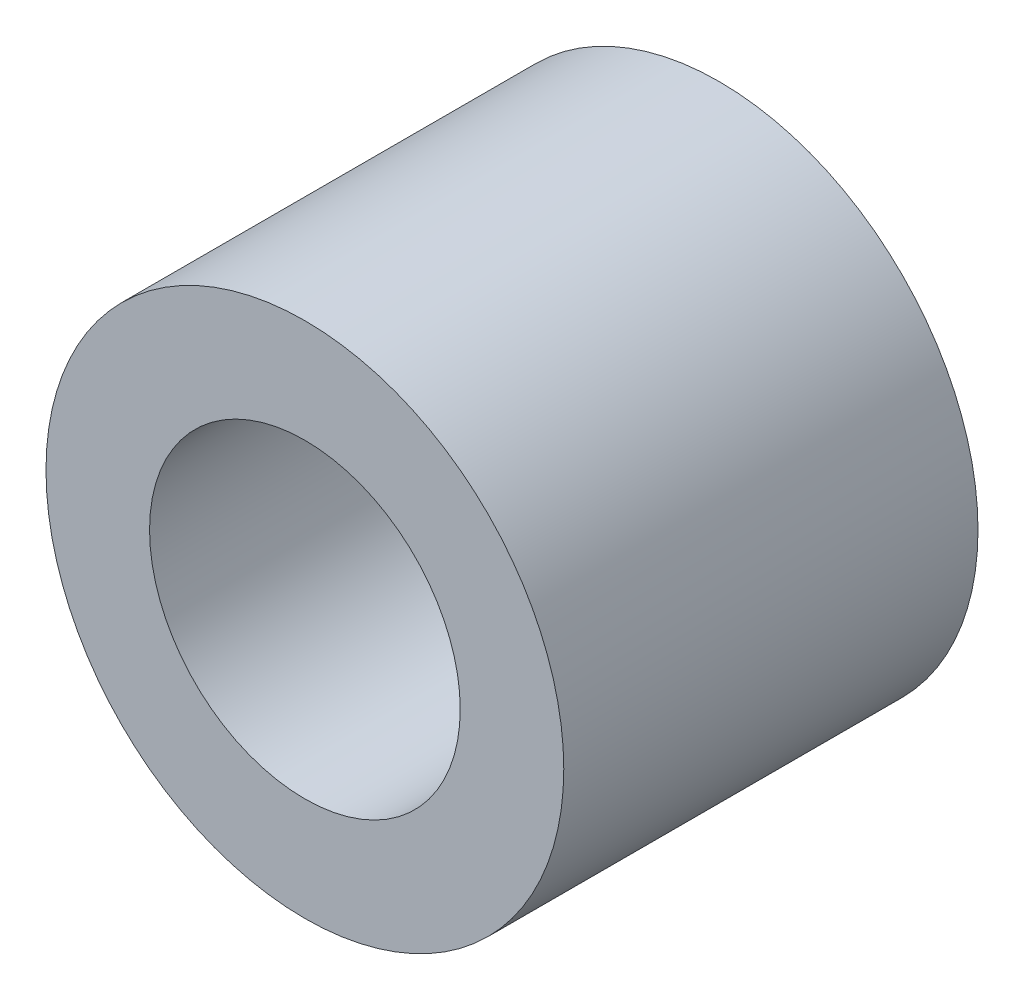
ISO-10303-21;
HEADER;
FILE_DESCRIPTION(('STEP AP214'),'2;1');
FILE_NAME('part.step','',(''),(''),'','','');
FILE_SCHEMA(('AUTOMOTIVE_DESIGN { 1 0 10303 214 1 1 1 1 }'));
ENDSEC;
DATA;
#1=APPLICATION_CONTEXT('core data for automotive mechanical design processes');
#2=APPLICATION_PROTOCOL_DEFINITION('international standard','automotive_design',2000,#1);
#3=PRODUCT_CONTEXT('',#1,'mechanical');
#4=PRODUCT('Part','Part','',(#3));
#5=PRODUCT_RELATED_PRODUCT_CATEGORY('part','',(#4));
#6=PRODUCT_DEFINITION_FORMATION('','',#4);
#7=PRODUCT_DEFINITION_CONTEXT('part definition',#1,'design');
#8=PRODUCT_DEFINITION('design','',#6,#7);
#9=PRODUCT_DEFINITION_SHAPE('','',#8);
#10=(LENGTH_UNIT() NAMED_UNIT(*) SI_UNIT(.MILLI.,.METRE.));
#11=(NAMED_UNIT(*) PLANE_ANGLE_UNIT() SI_UNIT($,.RADIAN.));
#12=(NAMED_UNIT(*) SI_UNIT($,.STERADIAN.) SOLID_ANGLE_UNIT());
#13=UNCERTAINTY_MEASURE_WITH_UNIT(LENGTH_MEASURE(1.E-05),#10,'distance_accuracy_value','');
#14=(GEOMETRIC_REPRESENTATION_CONTEXT(3) GLOBAL_UNCERTAINTY_ASSIGNED_CONTEXT((#13)) GLOBAL_UNIT_ASSIGNED_CONTEXT((#10,
#11,#12)) REPRESENTATION_CONTEXT('',''));
#15=CARTESIAN_POINT('',(0.,0.,0.));
#16=DIRECTION('',(0.,0.,1.));
#17=DIRECTION('',(1.,0.,0.));
#18=AXIS2_PLACEMENT_3D('',#15,#16,#17);
#19=CARTESIAN_POINT('',(0.,0.,-40.));
#20=DIRECTION('',(0.,0.,1.));
#21=DIRECTION('',(1.,0.,0.));
#22=AXIS2_PLACEMENT_3D('',#19,#20,#21);
#23=CYLINDRICAL_SURFACE('',#22,25.);
#24=CARTESIAN_POINT('',(0.,0.,-40.));
#25=DIRECTION('',(0.,0.,1.));
#26=DIRECTION('',(1.,0.,0.));
#27=AXIS2_PLACEMENT_3D('',#24,#25,#26);
#28=CIRCLE('',#27,25.);
#29=CARTESIAN_POINT('',(25.,0.,-40.));
#30=VERTEX_POINT('',#29);
#31=EDGE_CURVE('E10',#30,#30,#28,.T.);
#32=ORIENTED_EDGE('',*,*,#31,.T.);
#33=EDGE_LOOP('',(#32));
#34=FACE_BOUND('',#33,.T.);
#35=CARTESIAN_POINT('',(0.,0.,0.));
#36=DIRECTION('',(0.,0.,1.));
#37=DIRECTION('',(1.,0.,0.));
#38=AXIS2_PLACEMENT_3D('',#35,#36,#37);
#39=CIRCLE('',#38,25.);
#40=CARTESIAN_POINT('',(25.,0.,0.));
#41=VERTEX_POINT('',#40);
#42=EDGE_CURVE('E36',#41,#41,#39,.T.);
#43=ORIENTED_EDGE('',*,*,#42,.F.);
#44=EDGE_LOOP('',(#43));
#45=FACE_BOUND('',#44,.T.);
#46=ADVANCED_FACE('F33',(#34,#45),#23,.T.);
#47=CARTESIAN_POINT('',(0.,0.,-40.));
#48=DIRECTION('',(0.,0.,1.));
#49=DIRECTION('',(1.,0.,0.));
#50=AXIS2_PLACEMENT_3D('',#47,#48,#49);
#51=PLANE('',#50);
#52=CARTESIAN_POINT('',(0.,0.,-40.));
#53=DIRECTION('',(0.,0.,1.));
#54=DIRECTION('',(1.,0.,0.));
#55=AXIS2_PLACEMENT_3D('',#52,#53,#54);
#56=CIRCLE('',#55,15.);
#57=CARTESIAN_POINT('',(15.,0.,-40.));
#58=VERTEX_POINT('',#57);
#59=EDGE_CURVE('E43',#58,#58,#56,.T.);
#60=ORIENTED_EDGE('',*,*,#59,.T.);
#61=EDGE_LOOP('',(#60));
#62=FACE_BOUND('',#61,.T.);
#63=ORIENTED_EDGE('',*,*,#31,.F.);
#64=EDGE_LOOP('',(#63));
#65=FACE_BOUND('',#64,.T.);
#66=ADVANCED_FACE('F51',(#62,#65),#51,.F.);
#67=CARTESIAN_POINT('',(0.,0.,0.));
#68=DIRECTION('',(0.,0.,1.));
#69=DIRECTION('',(1.,0.,0.));
#70=AXIS2_PLACEMENT_3D('',#67,#68,#69);
#71=PLANE('',#70);
#72=CARTESIAN_POINT('',(0.,0.,0.));
#73=DIRECTION('',(0.,0.,1.));
#74=DIRECTION('',(1.,0.,0.));
#75=AXIS2_PLACEMENT_3D('',#72,#73,#74);
#76=CIRCLE('',#75,15.);
#77=CARTESIAN_POINT('',(15.,0.,0.));
#78=VERTEX_POINT('',#77);
#79=EDGE_CURVE('E45',#78,#78,#76,.T.);
#80=ORIENTED_EDGE('',*,*,#79,.F.);
#81=EDGE_LOOP('',(#80));
#82=FACE_BOUND('',#81,.T.);
#83=ORIENTED_EDGE('',*,*,#42,.T.);
#84=EDGE_LOOP('',(#83));
#85=FACE_BOUND('',#84,.T.);
#86=ADVANCED_FACE('F57',(#82,#85),#71,.T.);
#87=CARTESIAN_POINT('',(0.,0.,-40.));
#88=DIRECTION('',(0.,0.,1.));
#89=DIRECTION('',(1.,0.,0.));
#90=AXIS2_PLACEMENT_3D('',#87,#88,#89);
#91=CYLINDRICAL_SURFACE('',#90,15.);
#92=ORIENTED_EDGE('',*,*,#59,.F.);
#93=EDGE_LOOP('',(#92));
#94=FACE_BOUND('',#93,.T.);
#95=ORIENTED_EDGE('',*,*,#79,.T.);
#96=EDGE_LOOP('',(#95));
#97=FACE_BOUND('',#96,.T.);
#98=ADVANCED_FACE('F54',(#94,#97),#91,.F.);
#99=CLOSED_SHELL('',(#46,#66,#86,#98));
#100=MANIFOLD_SOLID_BREP('B2',#99);
#101=ADVANCED_BREP_SHAPE_REPRESENTATION('',(#18,#100),#14);
#102=SHAPE_DEFINITION_REPRESENTATION(#9,#101);
ENDSEC;
END-ISO-10303-21;
